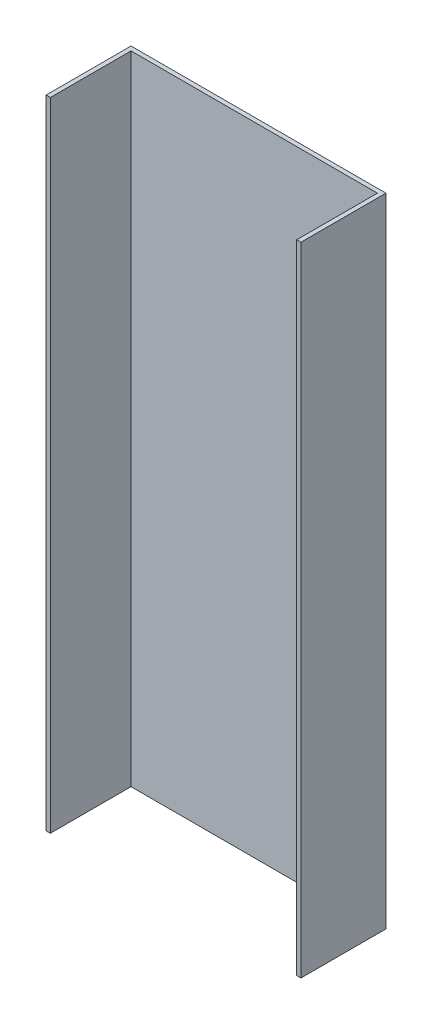
ISO-10303-21;
HEADER;
FILE_DESCRIPTION(('STEP AP214'),'2;1');
FILE_NAME('part.step','',(''),(''),'','','');
FILE_SCHEMA(('AUTOMOTIVE_DESIGN { 1 0 10303 214 1 1 1 1 }'));
ENDSEC;
DATA;
#1=APPLICATION_CONTEXT('core data for automotive mechanical design processes');
#2=APPLICATION_PROTOCOL_DEFINITION('international standard','automotive_design',2000,#1);
#3=PRODUCT_CONTEXT('',#1,'mechanical');
#4=PRODUCT('Part','Part','',(#3));
#5=PRODUCT_RELATED_PRODUCT_CATEGORY('part','',(#4));
#6=PRODUCT_DEFINITION_FORMATION('','',#4);
#7=PRODUCT_DEFINITION_CONTEXT('part definition',#1,'design');
#8=PRODUCT_DEFINITION('design','',#6,#7);
#9=PRODUCT_DEFINITION_SHAPE('','',#8);
#10=(LENGTH_UNIT() NAMED_UNIT(*) SI_UNIT(.MILLI.,.METRE.));
#11=(NAMED_UNIT(*) PLANE_ANGLE_UNIT() SI_UNIT($,.RADIAN.));
#12=(NAMED_UNIT(*) SI_UNIT($,.STERADIAN.) SOLID_ANGLE_UNIT());
#13=UNCERTAINTY_MEASURE_WITH_UNIT(LENGTH_MEASURE(1.E-05),#10,'distance_accuracy_value','');
#14=(GEOMETRIC_REPRESENTATION_CONTEXT(3) GLOBAL_UNCERTAINTY_ASSIGNED_CONTEXT((#13)) GLOBAL_UNIT_ASSIGNED_CONTEXT((#10,
#11,#12)) REPRESENTATION_CONTEXT('',''));
#15=CARTESIAN_POINT('',(0.,0.,0.));
#16=DIRECTION('',(0.,0.,1.));
#17=DIRECTION('',(1.,0.,0.));
#18=AXIS2_PLACEMENT_3D('',#15,#16,#17);
#19=CARTESIAN_POINT('',(300.,-750.,10.));
#20=DIRECTION('',(-1.,0.,0.));
#21=DIRECTION('',(0.,0.,1.));
#22=AXIS2_PLACEMENT_3D('',#19,#20,#21);
#23=PLANE('',#22);
#24=DIRECTION('',(0.,1.,0.));
#25=VECTOR('',#24,1.);
#26=CARTESIAN_POINT('',(300.,-750.,0.));
#27=LINE('',#26,#25);
#28=CARTESIAN_POINT('',(300.,-750.,0.));
#29=VERTEX_POINT('',#28);
#30=CARTESIAN_POINT('',(300.,750.,0.));
#31=VERTEX_POINT('',#30);
#32=EDGE_CURVE('E150',#29,#31,#27,.T.);
#33=ORIENTED_EDGE('',*,*,#32,.T.);
#34=DIRECTION('',(0.,0.,-1.));
#35=VECTOR('',#34,1.);
#36=CARTESIAN_POINT('',(300.,750.,10.));
#37=LINE('',#36,#35);
#38=CARTESIAN_POINT('',(300.,750.,200.));
#39=VERTEX_POINT('',#38);
#40=EDGE_CURVE('E11',#39,#31,#37,.T.);
#41=ORIENTED_EDGE('',*,*,#40,.F.);
#42=DIRECTION('',(0.,1.,0.));
#43=VECTOR('',#42,1.);
#44=CARTESIAN_POINT('',(300.,-750.,200.));
#45=LINE('',#44,#43);
#46=CARTESIAN_POINT('',(300.,-750.,200.));
#47=VERTEX_POINT('',#46);
#48=EDGE_CURVE('E137',#47,#39,#45,.T.);
#49=ORIENTED_EDGE('',*,*,#48,.F.);
#50=DIRECTION('',(0.,0.,-1.));
#51=VECTOR('',#50,1.);
#52=CARTESIAN_POINT('',(300.,-750.,10.));
#53=LINE('',#52,#51);
#54=EDGE_CURVE('E154',#47,#29,#53,.T.);
#55=ORIENTED_EDGE('',*,*,#54,.T.);
#56=EDGE_LOOP('',(#33,#41,#49,#55));
#57=FACE_BOUND('',#56,.T.);
#58=ADVANCED_FACE('F39',(#57),#23,.F.);
#59=CARTESIAN_POINT('',(-300.,750.,10.));
#60=DIRECTION('',(0.,-1.,0.));
#61=DIRECTION('',(0.,0.,-1.));
#62=AXIS2_PLACEMENT_3D('',#59,#60,#61);
#63=PLANE('',#62);
#64=DIRECTION('',(-1.,0.,0.));
#65=VECTOR('',#64,1.);
#66=CARTESIAN_POINT('',(-300.,750.,0.));
#67=LINE('',#66,#65);
#68=CARTESIAN_POINT('',(-300.,750.,0.));
#69=VERTEX_POINT('',#68);
#70=EDGE_CURVE('E157',#31,#69,#67,.T.);
#71=ORIENTED_EDGE('',*,*,#70,.T.);
#72=DIRECTION('',(0.,0.,-1.));
#73=VECTOR('',#72,1.);
#74=CARTESIAN_POINT('',(-300.,750.,10.));
#75=LINE('',#74,#73);
#76=CARTESIAN_POINT('',(-300.,750.,200.));
#77=VERTEX_POINT('',#76);
#78=EDGE_CURVE('E46',#77,#69,#75,.T.);
#79=ORIENTED_EDGE('',*,*,#78,.F.);
#80=DIRECTION('',(-1.,0.,0.));
#81=VECTOR('',#80,1.);
#82=CARTESIAN_POINT('',(-290.,750.,200.));
#83=LINE('',#82,#81);
#84=CARTESIAN_POINT('',(-290.,750.,200.));
#85=VERTEX_POINT('',#84);
#86=EDGE_CURVE('E120',#85,#77,#83,.T.);
#87=ORIENTED_EDGE('',*,*,#86,.F.);
#88=DIRECTION('',(0.,0.,-1.));
#89=VECTOR('',#88,1.);
#90=CARTESIAN_POINT('',(-290.,750.,200.));
#91=LINE('',#90,#89);
#92=CARTESIAN_POINT('',(-290.,750.,10.));
#93=VERTEX_POINT('',#92);
#94=EDGE_CURVE('E119',#85,#93,#91,.T.);
#95=ORIENTED_EDGE('',*,*,#94,.T.);
#96=DIRECTION('',(-1.,0.,0.));
#97=VECTOR('',#96,1.);
#98=CARTESIAN_POINT('',(-300.,750.,10.));
#99=LINE('',#98,#97);
#100=CARTESIAN_POINT('',(290.,750.,10.));
#101=VERTEX_POINT('',#100);
#102=EDGE_CURVE('E53',#101,#93,#99,.T.);
#103=ORIENTED_EDGE('',*,*,#102,.F.);
#104=DIRECTION('',(0.,0.,-1.));
#105=VECTOR('',#104,1.);
#106=CARTESIAN_POINT('',(290.,750.,200.));
#107=LINE('',#106,#105);
#108=CARTESIAN_POINT('',(290.,750.,200.));
#109=VERTEX_POINT('',#108);
#110=EDGE_CURVE('E143',#109,#101,#107,.T.);
#111=ORIENTED_EDGE('',*,*,#110,.F.);
#112=DIRECTION('',(-1.,0.,0.));
#113=VECTOR('',#112,1.);
#114=CARTESIAN_POINT('',(300.,750.,200.));
#115=LINE('',#114,#113);
#116=EDGE_CURVE('E135',#39,#109,#115,.T.);
#117=ORIENTED_EDGE('',*,*,#116,.F.);
#118=ORIENTED_EDGE('',*,*,#40,.T.);
#119=EDGE_LOOP('',(#71,#79,#87,#95,#103,#111,#117,#118));
#120=FACE_BOUND('',#119,.T.);
#121=ADVANCED_FACE('F182',(#120),#63,.F.);
#122=CARTESIAN_POINT('',(-300.,-750.,10.));
#123=DIRECTION('',(1.,0.,0.));
#124=DIRECTION('',(0.,0.,-1.));
#125=AXIS2_PLACEMENT_3D('',#122,#123,#124);
#126=PLANE('',#125);
#127=DIRECTION('',(0.,-1.,0.));
#128=VECTOR('',#127,1.);
#129=CARTESIAN_POINT('',(-300.,-750.,0.));
#130=LINE('',#129,#128);
#131=CARTESIAN_POINT('',(-300.,-750.,0.));
#132=VERTEX_POINT('',#131);
#133=EDGE_CURVE('E159',#69,#132,#130,.T.);
#134=ORIENTED_EDGE('',*,*,#133,.T.);
#135=DIRECTION('',(0.,0.,-1.));
#136=VECTOR('',#135,1.);
#137=CARTESIAN_POINT('',(-300.,-750.,10.));
#138=LINE('',#137,#136);
#139=CARTESIAN_POINT('',(-300.,-750.,200.));
#140=VERTEX_POINT('',#139);
#141=EDGE_CURVE('E164',#140,#132,#138,.T.);
#142=ORIENTED_EDGE('',*,*,#141,.F.);
#143=DIRECTION('',(0.,-1.,0.));
#144=VECTOR('',#143,1.);
#145=CARTESIAN_POINT('',(-300.,750.,200.));
#146=LINE('',#145,#144);
#147=EDGE_CURVE('E110',#77,#140,#146,.T.);
#148=ORIENTED_EDGE('',*,*,#147,.F.);
#149=ORIENTED_EDGE('',*,*,#78,.T.);
#150=EDGE_LOOP('',(#134,#142,#148,#149));
#151=FACE_BOUND('',#150,.T.);
#152=ADVANCED_FACE('F168',(#151),#126,.F.);
#153=CARTESIAN_POINT('',(-300.,-750.,10.));
#154=DIRECTION('',(0.,1.,0.));
#155=DIRECTION('',(0.,0.,1.));
#156=AXIS2_PLACEMENT_3D('',#153,#154,#155);
#157=PLANE('',#156);
#158=DIRECTION('',(1.,0.,0.));
#159=VECTOR('',#158,1.);
#160=CARTESIAN_POINT('',(-300.,-750.,10.));
#161=LINE('',#160,#159);
#162=CARTESIAN_POINT('',(-290.,-750.,10.));
#163=VERTEX_POINT('',#162);
#164=CARTESIAN_POINT('',(290.,-750.,10.));
#165=VERTEX_POINT('',#164);
#166=EDGE_CURVE('E58',#163,#165,#161,.T.);
#167=ORIENTED_EDGE('',*,*,#166,.F.);
#168=DIRECTION('',(0.,0.,-1.));
#169=VECTOR('',#168,1.);
#170=CARTESIAN_POINT('',(-290.,-750.,200.));
#171=LINE('',#170,#169);
#172=CARTESIAN_POINT('',(-290.,-750.,200.));
#173=VERTEX_POINT('',#172);
#174=EDGE_CURVE('E115',#173,#163,#171,.T.);
#175=ORIENTED_EDGE('',*,*,#174,.F.);
#176=DIRECTION('',(1.,0.,0.));
#177=VECTOR('',#176,1.);
#178=CARTESIAN_POINT('',(-300.,-750.,200.));
#179=LINE('',#178,#177);
#180=EDGE_CURVE('E103',#140,#173,#179,.T.);
#181=ORIENTED_EDGE('',*,*,#180,.F.);
#182=ORIENTED_EDGE('',*,*,#141,.T.);
#183=DIRECTION('',(1.,0.,0.));
#184=VECTOR('',#183,1.);
#185=CARTESIAN_POINT('',(-300.,-750.,0.));
#186=LINE('',#185,#184);
#187=EDGE_CURVE('E152',#132,#29,#186,.T.);
#188=ORIENTED_EDGE('',*,*,#187,.T.);
#189=ORIENTED_EDGE('',*,*,#54,.F.);
#190=DIRECTION('',(1.,0.,0.));
#191=VECTOR('',#190,1.);
#192=CARTESIAN_POINT('',(290.,-750.,200.));
#193=LINE('',#192,#191);
#194=CARTESIAN_POINT('',(290.,-750.,200.));
#195=VERTEX_POINT('',#194);
#196=EDGE_CURVE('E140',#195,#47,#193,.T.);
#197=ORIENTED_EDGE('',*,*,#196,.F.);
#198=DIRECTION('',(0.,0.,-1.));
#199=VECTOR('',#198,1.);
#200=CARTESIAN_POINT('',(290.,-750.,200.));
#201=LINE('',#200,#199);
#202=EDGE_CURVE('E144',#195,#165,#201,.T.);
#203=ORIENTED_EDGE('',*,*,#202,.T.);
#204=EDGE_LOOP('',(#167,#175,#181,#182,#188,#189,#197,#203));
#205=FACE_BOUND('',#204,.T.);
#206=ADVANCED_FACE('F116',(#205),#157,.F.);
#207=CARTESIAN_POINT('',(0.,0.,10.));
#208=DIRECTION('',(0.,0.,-1.));
#209=DIRECTION('',(-1.,0.,0.));
#210=AXIS2_PLACEMENT_3D('',#207,#208,#209);
#211=PLANE('',#210);
#212=ORIENTED_EDGE('',*,*,#102,.T.);
#213=DIRECTION('',(0.,-1.,0.));
#214=VECTOR('',#213,1.);
#215=CARTESIAN_POINT('',(-290.,0.,10.));
#216=LINE('',#215,#214);
#217=EDGE_CURVE('E129',#93,#163,#216,.T.);
#218=ORIENTED_EDGE('',*,*,#217,.T.);
#219=ORIENTED_EDGE('',*,*,#166,.T.);
#220=DIRECTION('',(0.,1.,0.));
#221=VECTOR('',#220,1.);
#222=CARTESIAN_POINT('',(290.,0.,10.));
#223=LINE('',#222,#221);
#224=EDGE_CURVE('E146',#165,#101,#223,.T.);
#225=ORIENTED_EDGE('',*,*,#224,.T.);
#226=EDGE_LOOP('',(#212,#218,#219,#225));
#227=FACE_BOUND('',#226,.T.);
#228=ADVANCED_FACE('F185',(#227),#211,.F.);
#229=CARTESIAN_POINT('',(0.,0.,0.));
#230=DIRECTION('',(0.,0.,-1.));
#231=DIRECTION('',(-1.,0.,0.));
#232=AXIS2_PLACEMENT_3D('',#229,#230,#231);
#233=PLANE('',#232);
#234=ORIENTED_EDGE('',*,*,#32,.F.);
#235=ORIENTED_EDGE('',*,*,#187,.F.);
#236=ORIENTED_EDGE('',*,*,#133,.F.);
#237=ORIENTED_EDGE('',*,*,#70,.F.);
#238=EDGE_LOOP('',(#234,#235,#236,#237));
#239=FACE_BOUND('',#238,.T.);
#240=ADVANCED_FACE('F173',(#239),#233,.T.);
#241=CARTESIAN_POINT('',(290.,-750.,200.));
#242=DIRECTION('',(-1.,0.,0.));
#243=DIRECTION('',(0.,0.,1.));
#244=AXIS2_PLACEMENT_3D('',#241,#242,#243);
#245=PLANE('',#244);
#246=ORIENTED_EDGE('',*,*,#224,.F.);
#247=ORIENTED_EDGE('',*,*,#202,.F.);
#248=DIRECTION('',(0.,1.,0.));
#249=VECTOR('',#248,1.);
#250=CARTESIAN_POINT('',(290.,-750.,200.));
#251=LINE('',#250,#249);
#252=EDGE_CURVE('E132',#195,#109,#251,.T.);
#253=ORIENTED_EDGE('',*,*,#252,.T.);
#254=ORIENTED_EDGE('',*,*,#110,.T.);
#255=EDGE_LOOP('',(#246,#247,#253,#254));
#256=FACE_BOUND('',#255,.T.);
#257=ADVANCED_FACE('F184',(#256),#245,.T.);
#258=CARTESIAN_POINT('',(0.,0.,200.));
#259=DIRECTION('',(0.,0.,1.));
#260=DIRECTION('',(1.,0.,0.));
#261=AXIS2_PLACEMENT_3D('',#258,#259,#260);
#262=PLANE('',#261);
#263=ORIENTED_EDGE('',*,*,#252,.F.);
#264=ORIENTED_EDGE('',*,*,#196,.T.);
#265=ORIENTED_EDGE('',*,*,#48,.T.);
#266=ORIENTED_EDGE('',*,*,#116,.T.);
#267=EDGE_LOOP('',(#263,#264,#265,#266));
#268=FACE_BOUND('',#267,.T.);
#269=ADVANCED_FACE('F180',(#268),#262,.T.);
#270=CARTESIAN_POINT('',(-290.,750.,200.));
#271=DIRECTION('',(1.,0.,0.));
#272=DIRECTION('',(0.,0.,-1.));
#273=AXIS2_PLACEMENT_3D('',#270,#271,#272);
#274=PLANE('',#273);
#275=ORIENTED_EDGE('',*,*,#217,.F.);
#276=ORIENTED_EDGE('',*,*,#94,.F.);
#277=DIRECTION('',(0.,1.,0.));
#278=VECTOR('',#277,1.);
#279=CARTESIAN_POINT('',(-290.,750.,200.));
#280=LINE('',#279,#278);
#281=EDGE_CURVE('E108',#85,#173,#280,.F.);
#282=ORIENTED_EDGE('',*,*,#281,.T.);
#283=ORIENTED_EDGE('',*,*,#174,.T.);
#284=EDGE_LOOP('',(#275,#276,#282,#283));
#285=FACE_BOUND('',#284,.T.);
#286=ADVANCED_FACE('F122',(#285),#274,.T.);
#287=CARTESIAN_POINT('',(0.,0.,200.));
#288=DIRECTION('',(0.,0.,-1.));
#289=DIRECTION('',(-1.,0.,0.));
#290=AXIS2_PLACEMENT_3D('',#287,#288,#289);
#291=PLANE('',#290);
#292=ORIENTED_EDGE('',*,*,#281,.F.);
#293=ORIENTED_EDGE('',*,*,#86,.T.);
#294=ORIENTED_EDGE('',*,*,#147,.T.);
#295=ORIENTED_EDGE('',*,*,#180,.T.);
#296=EDGE_LOOP('',(#292,#293,#294,#295));
#297=FACE_BOUND('',#296,.T.);
#298=ADVANCED_FACE('F105',(#297),#291,.F.);
#299=CLOSED_SHELL('',(#58,#121,#152,#206,#228,#240,#257,#269,#286,#298));
#300=MANIFOLD_SOLID_BREP('B2',#299);
#301=ADVANCED_BREP_SHAPE_REPRESENTATION('',(#18,#300),#14);
#302=SHAPE_DEFINITION_REPRESENTATION(#9,#301);
ENDSEC;
END-ISO-10303-21;
